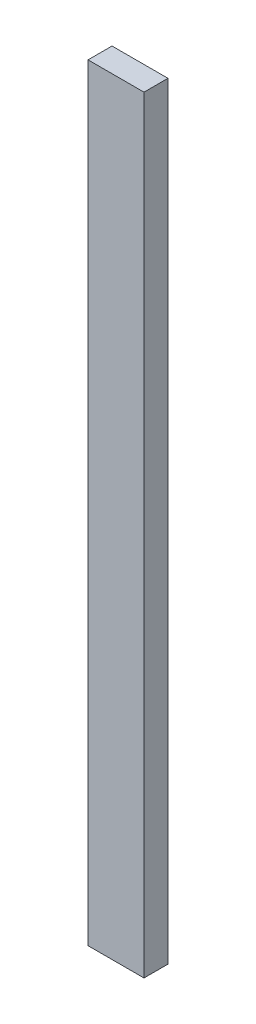
ISO-10303-21;
HEADER;
FILE_DESCRIPTION(('STEP AP214'),'2;1');
FILE_NAME('part.step','',(''),(''),'','','');
FILE_SCHEMA(('AUTOMOTIVE_DESIGN { 1 0 10303 214 1 1 1 1 }'));
ENDSEC;
DATA;
#1=APPLICATION_CONTEXT('core data for automotive mechanical design processes');
#2=APPLICATION_PROTOCOL_DEFINITION('international standard','automotive_design',2000,#1);
#3=PRODUCT_CONTEXT('',#1,'mechanical');
#4=PRODUCT('Part','Part','',(#3));
#5=PRODUCT_RELATED_PRODUCT_CATEGORY('part','',(#4));
#6=PRODUCT_DEFINITION_FORMATION('','',#4);
#7=PRODUCT_DEFINITION_CONTEXT('part definition',#1,'design');
#8=PRODUCT_DEFINITION('design','',#6,#7);
#9=PRODUCT_DEFINITION_SHAPE('','',#8);
#10=(LENGTH_UNIT() NAMED_UNIT(*) SI_UNIT(.MILLI.,.METRE.));
#11=(NAMED_UNIT(*) PLANE_ANGLE_UNIT() SI_UNIT($,.RADIAN.));
#12=(NAMED_UNIT(*) SI_UNIT($,.STERADIAN.) SOLID_ANGLE_UNIT());
#13=UNCERTAINTY_MEASURE_WITH_UNIT(LENGTH_MEASURE(1.E-05),#10,'distance_accuracy_value','');
#14=(GEOMETRIC_REPRESENTATION_CONTEXT(3) GLOBAL_UNCERTAINTY_ASSIGNED_CONTEXT((#13)) GLOBAL_UNIT_ASSIGNED_CONTEXT((#10,
#11,#12)) REPRESENTATION_CONTEXT('',''));
#15=CARTESIAN_POINT('',(0.,0.,0.));
#16=DIRECTION('',(0.,0.,1.));
#17=DIRECTION('',(1.,0.,0.));
#18=AXIS2_PLACEMENT_3D('',#15,#16,#17);
#19=CARTESIAN_POINT('',(-44.45,1219.2,19.05));
#20=DIRECTION('',(-1.,0.,0.));
#21=DIRECTION('',(0.,0.,1.));
#22=AXIS2_PLACEMENT_3D('',#19,#20,#21);
#23=PLANE('',#22);
#24=DIRECTION('',(0.,0.,-1.));
#25=VECTOR('',#24,1.);
#26=CARTESIAN_POINT('',(-44.45,0.,19.05));
#27=LINE('',#26,#25);
#28=CARTESIAN_POINT('',(-44.45,0.,19.05));
#29=VERTEX_POINT('',#28);
#30=CARTESIAN_POINT('',(-44.45,0.,-19.05));
#31=VERTEX_POINT('',#30);
#32=EDGE_CURVE('E104',#29,#31,#27,.T.);
#33=ORIENTED_EDGE('',*,*,#32,.F.);
#34=DIRECTION('',(0.,-1.,0.));
#35=VECTOR('',#34,1.);
#36=CARTESIAN_POINT('',(-44.45,1219.2,19.05));
#37=LINE('',#36,#35);
#38=CARTESIAN_POINT('',(-44.45,1219.2,19.05));
#39=VERTEX_POINT('',#38);
#40=EDGE_CURVE('E11',#39,#29,#37,.T.);
#41=ORIENTED_EDGE('',*,*,#40,.F.);
#42=DIRECTION('',(0.,0.,-1.));
#43=VECTOR('',#42,1.);
#44=CARTESIAN_POINT('',(-44.45,1219.2,19.05));
#45=LINE('',#44,#43);
#46=CARTESIAN_POINT('',(-44.45,1219.2,-19.05));
#47=VERTEX_POINT('',#46);
#48=EDGE_CURVE('E99',#39,#47,#45,.T.);
#49=ORIENTED_EDGE('',*,*,#48,.T.);
#50=DIRECTION('',(0.,-1.,0.));
#51=VECTOR('',#50,1.);
#52=CARTESIAN_POINT('',(-44.45,1219.2,-19.05));
#53=LINE('',#52,#51);
#54=EDGE_CURVE('E42',#47,#31,#53,.T.);
#55=ORIENTED_EDGE('',*,*,#54,.T.);
#56=EDGE_LOOP('',(#33,#41,#49,#55));
#57=FACE_BOUND('',#56,.T.);
#58=ADVANCED_FACE('F39',(#57),#23,.T.);
#59=CARTESIAN_POINT('',(-44.45,1219.2,19.05));
#60=DIRECTION('',(0.,0.,-1.));
#61=DIRECTION('',(-1.,0.,0.));
#62=AXIS2_PLACEMENT_3D('',#59,#60,#61);
#63=PLANE('',#62);
#64=DIRECTION('',(1.,0.,0.));
#65=VECTOR('',#64,1.);
#66=CARTESIAN_POINT('',(-44.45,0.,19.05));
#67=LINE('',#66,#65);
#68=CARTESIAN_POINT('',(44.45,0.,19.05));
#69=VERTEX_POINT('',#68);
#70=EDGE_CURVE('E72',#29,#69,#67,.T.);
#71=ORIENTED_EDGE('',*,*,#70,.T.);
#72=DIRECTION('',(0.,-1.,0.));
#73=VECTOR('',#72,1.);
#74=CARTESIAN_POINT('',(44.45,1219.2,19.05));
#75=LINE('',#74,#73);
#76=CARTESIAN_POINT('',(44.45,1219.2,19.05));
#77=VERTEX_POINT('',#76);
#78=EDGE_CURVE('E48',#77,#69,#75,.T.);
#79=ORIENTED_EDGE('',*,*,#78,.F.);
#80=DIRECTION('',(1.,0.,0.));
#81=VECTOR('',#80,1.);
#82=CARTESIAN_POINT('',(-44.45,1219.2,19.05));
#83=LINE('',#82,#81);
#84=EDGE_CURVE('E89',#39,#77,#83,.T.);
#85=ORIENTED_EDGE('',*,*,#84,.F.);
#86=ORIENTED_EDGE('',*,*,#40,.T.);
#87=EDGE_LOOP('',(#71,#79,#85,#86));
#88=FACE_BOUND('',#87,.T.);
#89=ADVANCED_FACE('F114',(#88),#63,.F.);
#90=CARTESIAN_POINT('',(44.45,1219.2,19.05));
#91=DIRECTION('',(-1.,0.,0.));
#92=DIRECTION('',(0.,0.,1.));
#93=AXIS2_PLACEMENT_3D('',#90,#91,#92);
#94=PLANE('',#93);
#95=DIRECTION('',(0.,0.,-1.));
#96=VECTOR('',#95,1.);
#97=CARTESIAN_POINT('',(44.45,0.,19.05));
#98=LINE('',#97,#96);
#99=CARTESIAN_POINT('',(44.45,0.,-19.05));
#100=VERTEX_POINT('',#99);
#101=EDGE_CURVE('E96',#69,#100,#98,.T.);
#102=ORIENTED_EDGE('',*,*,#101,.T.);
#103=DIRECTION('',(0.,-1.,0.));
#104=VECTOR('',#103,1.);
#105=CARTESIAN_POINT('',(44.45,1219.2,-19.05));
#106=LINE('',#105,#104);
#107=CARTESIAN_POINT('',(44.45,1219.2,-19.05));
#108=VERTEX_POINT('',#107);
#109=EDGE_CURVE('E93',#108,#100,#106,.T.);
#110=ORIENTED_EDGE('',*,*,#109,.F.);
#111=DIRECTION('',(0.,0.,-1.));
#112=VECTOR('',#111,1.);
#113=CARTESIAN_POINT('',(44.45,1219.2,19.05));
#114=LINE('',#113,#112);
#115=EDGE_CURVE('E84',#77,#108,#114,.T.);
#116=ORIENTED_EDGE('',*,*,#115,.F.);
#117=ORIENTED_EDGE('',*,*,#78,.T.);
#118=EDGE_LOOP('',(#102,#110,#116,#117));
#119=FACE_BOUND('',#118,.T.);
#120=ADVANCED_FACE('F94',(#119),#94,.F.);
#121=CARTESIAN_POINT('',(-44.45,1219.2,-19.05));
#122=DIRECTION('',(0.,0.,-1.));
#123=DIRECTION('',(-1.,0.,0.));
#124=AXIS2_PLACEMENT_3D('',#121,#122,#123);
#125=PLANE('',#124);
#126=DIRECTION('',(1.,0.,0.));
#127=VECTOR('',#126,1.);
#128=CARTESIAN_POINT('',(-44.45,0.,-19.05));
#129=LINE('',#128,#127);
#130=EDGE_CURVE('E107',#31,#100,#129,.T.);
#131=ORIENTED_EDGE('',*,*,#130,.F.);
#132=ORIENTED_EDGE('',*,*,#54,.F.);
#133=DIRECTION('',(1.,0.,0.));
#134=VECTOR('',#133,1.);
#135=CARTESIAN_POINT('',(-44.45,1219.2,-19.05));
#136=LINE('',#135,#134);
#137=EDGE_CURVE('E88',#47,#108,#136,.T.);
#138=ORIENTED_EDGE('',*,*,#137,.T.);
#139=ORIENTED_EDGE('',*,*,#109,.T.);
#140=EDGE_LOOP('',(#131,#132,#138,#139));
#141=FACE_BOUND('',#140,.T.);
#142=ADVANCED_FACE('F98',(#141),#125,.T.);
#143=CARTESIAN_POINT('',(0.,1219.2,0.));
#144=DIRECTION('',(0.,-1.,0.));
#145=DIRECTION('',(0.,0.,-1.));
#146=AXIS2_PLACEMENT_3D('',#143,#144,#145);
#147=PLANE('',#146);
#148=ORIENTED_EDGE('',*,*,#48,.F.);
#149=ORIENTED_EDGE('',*,*,#84,.T.);
#150=ORIENTED_EDGE('',*,*,#115,.T.);
#151=ORIENTED_EDGE('',*,*,#137,.F.);
#152=EDGE_LOOP('',(#148,#149,#150,#151));
#153=FACE_BOUND('',#152,.T.);
#154=ADVANCED_FACE('F87',(#153),#147,.F.);
#155=CARTESIAN_POINT('',(0.,0.,0.));
#156=DIRECTION('',(0.,-1.,0.));
#157=DIRECTION('',(0.,0.,-1.));
#158=AXIS2_PLACEMENT_3D('',#155,#156,#157);
#159=PLANE('',#158);
#160=ORIENTED_EDGE('',*,*,#32,.T.);
#161=ORIENTED_EDGE('',*,*,#130,.T.);
#162=ORIENTED_EDGE('',*,*,#101,.F.);
#163=ORIENTED_EDGE('',*,*,#70,.F.);
#164=EDGE_LOOP('',(#160,#161,#162,#163));
#165=FACE_BOUND('',#164,.T.);
#166=ADVANCED_FACE('F112',(#165),#159,.T.);
#167=CLOSED_SHELL('',(#58,#89,#120,#142,#154,#166));
#168=MANIFOLD_SOLID_BREP('B2',#167);
#169=ADVANCED_BREP_SHAPE_REPRESENTATION('',(#18,#168),#14);
#170=SHAPE_DEFINITION_REPRESENTATION(#9,#169);
ENDSEC;
END-ISO-10303-21;
